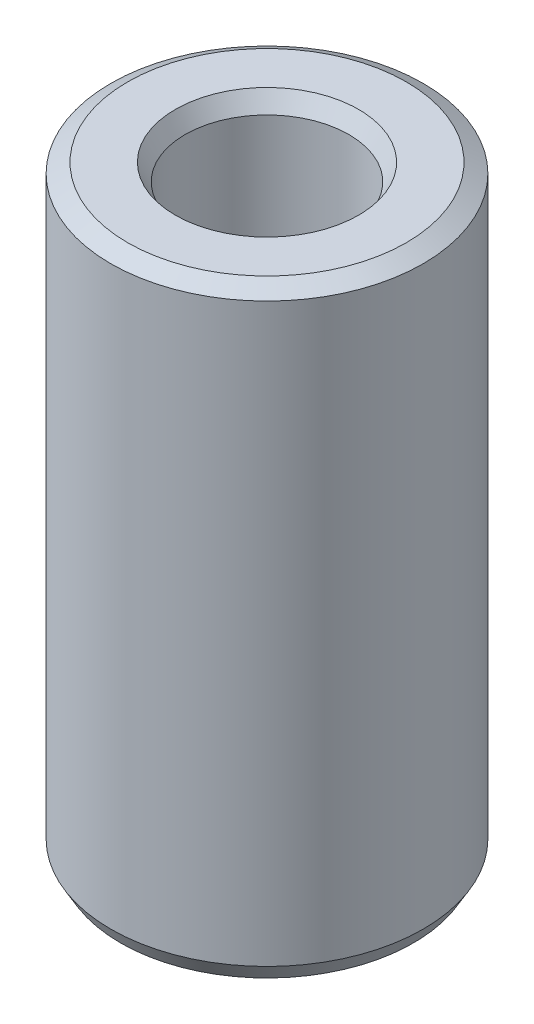
ISO-10303-21;
HEADER;
FILE_DESCRIPTION(('STEP AP214'),'2;1');
FILE_NAME('part.step','',(''),(''),'','','');
FILE_SCHEMA(('AUTOMOTIVE_DESIGN { 1 0 10303 214 1 1 1 1 }'));
ENDSEC;
DATA;
#1=APPLICATION_CONTEXT('core data for automotive mechanical design processes');
#2=APPLICATION_PROTOCOL_DEFINITION('international standard','automotive_design',2000,#1);
#3=PRODUCT_CONTEXT('',#1,'mechanical');
#4=PRODUCT('Part','Part','',(#3));
#5=PRODUCT_RELATED_PRODUCT_CATEGORY('part','',(#4));
#6=PRODUCT_DEFINITION_FORMATION('','',#4);
#7=PRODUCT_DEFINITION_CONTEXT('part definition',#1,'design');
#8=PRODUCT_DEFINITION('design','',#6,#7);
#9=PRODUCT_DEFINITION_SHAPE('','',#8);
#10=(LENGTH_UNIT() NAMED_UNIT(*) SI_UNIT(.MILLI.,.METRE.));
#11=(NAMED_UNIT(*) PLANE_ANGLE_UNIT() SI_UNIT($,.RADIAN.));
#12=(NAMED_UNIT(*) SI_UNIT($,.STERADIAN.) SOLID_ANGLE_UNIT());
#13=UNCERTAINTY_MEASURE_WITH_UNIT(LENGTH_MEASURE(1.E-05),#10,'distance_accuracy_value','');
#14=(GEOMETRIC_REPRESENTATION_CONTEXT(3) GLOBAL_UNCERTAINTY_ASSIGNED_CONTEXT((#13)) GLOBAL_UNIT_ASSIGNED_CONTEXT((#10,
#11,#12)) REPRESENTATION_CONTEXT('',''));
#15=CARTESIAN_POINT('',(0.,0.,0.));
#16=DIRECTION('',(0.,0.,1.));
#17=DIRECTION('',(1.,0.,0.));
#18=AXIS2_PLACEMENT_3D('',#15,#16,#17);
#19=CARTESIAN_POINT('',(0.,231.571872817268,0.));
#20=DIRECTION('',(0.,-1.,0.));
#21=DIRECTION('',(0.,0.,-1.));
#22=AXIS2_PLACEMENT_3D('',#19,#20,#21);
#23=CYLINDRICAL_SURFACE('',#22,60.);
#24=CARTESIAN_POINT('',(0.,6.48512513341329,0.));
#25=DIRECTION('',(0.,1.,0.));
#26=DIRECTION('',(0.,0.,1.));
#27=AXIS2_PLACEMENT_3D('',#24,#25,#26);
#28=CIRCLE('',#27,60.);
#29=CARTESIAN_POINT('',(0.,6.48512513341329,60.));
#30=VERTEX_POINT('',#29);
#31=EDGE_CURVE('E10',#30,#30,#28,.T.);
#32=ORIENTED_EDGE('',*,*,#31,.T.);
#33=EDGE_LOOP('',(#32));
#34=FACE_BOUND('',#33,.T.);
#35=CARTESIAN_POINT('',(0.,227.827684075764,0.));
#36=DIRECTION('',(0.,1.,0.));
#37=DIRECTION('',(0.,0.,1.));
#38=AXIS2_PLACEMENT_3D('',#35,#36,#37);
#39=CIRCLE('',#38,60.);
#40=CARTESIAN_POINT('',(0.,227.827684075764,60.));
#41=VERTEX_POINT('',#40);
#42=EDGE_CURVE('E50',#41,#41,#39,.F.);
#43=ORIENTED_EDGE('',*,*,#42,.T.);
#44=EDGE_LOOP('',(#43));
#45=FACE_BOUND('',#44,.T.);
#46=ADVANCED_FACE('F39',(#34,#45),#23,.T.);
#47=CARTESIAN_POINT('',(0.,231.571872817268,0.));
#48=DIRECTION('',(0.,1.,0.));
#49=DIRECTION('',(0.,0.,1.));
#50=AXIS2_PLACEMENT_3D('',#47,#48,#49);
#51=PLANE('',#50);
#52=CARTESIAN_POINT('',(0.,231.571872817268,0.));
#53=DIRECTION('',(0.,1.,0.));
#54=DIRECTION('',(0.,0.,1.));
#55=AXIS2_PLACEMENT_3D('',#52,#53,#54);
#56=CIRCLE('',#55,35.2071124474245);
#57=CARTESIAN_POINT('',(0.,231.571872817268,35.2071124474245));
#58=VERTEX_POINT('',#57);
#59=EDGE_CURVE('E58',#58,#58,#56,.F.);
#60=ORIENTED_EDGE('',*,*,#59,.T.);
#61=EDGE_LOOP('',(#60));
#62=FACE_BOUND('',#61,.T.);
#63=CARTESIAN_POINT('',(0.,231.571872817268,0.));
#64=DIRECTION('',(0.,1.,0.));
#65=DIRECTION('',(0.,0.,1.));
#66=AXIS2_PLACEMENT_3D('',#63,#64,#65);
#67=CIRCLE('',#66,53.5148748665867);
#68=CARTESIAN_POINT('',(0.,231.571872817268,53.5148748665867));
#69=VERTEX_POINT('',#68);
#70=EDGE_CURVE('E61',#69,#69,#67,.T.);
#71=ORIENTED_EDGE('',*,*,#70,.T.);
#72=EDGE_LOOP('',(#71));
#73=FACE_BOUND('',#72,.T.);
#74=ADVANCED_FACE('F88',(#62,#73),#51,.T.);
#75=CARTESIAN_POINT('',(0.,0.,0.));
#76=DIRECTION('',(0.,1.,0.));
#77=DIRECTION('',(0.,0.,1.));
#78=AXIS2_PLACEMENT_3D('',#75,#76,#77);
#79=PLANE('',#78);
#80=CARTESIAN_POINT('',(0.,0.,0.));
#81=DIRECTION('',(0.,1.,0.));
#82=DIRECTION('',(0.,0.,1.));
#83=AXIS2_PLACEMENT_3D('',#80,#81,#82);
#84=CIRCLE('',#83,37.9480488393332);
#85=CARTESIAN_POINT('',(0.,0.,37.9480488393332));
#86=VERTEX_POINT('',#85);
#87=EDGE_CURVE('E51',#86,#86,#84,.T.);
#88=ORIENTED_EDGE('',*,*,#87,.T.);
#89=EDGE_LOOP('',(#88));
#90=FACE_BOUND('',#89,.T.);
#91=CARTESIAN_POINT('',(0.,0.,0.));
#92=DIRECTION('',(0.,1.,0.));
#93=DIRECTION('',(0.,0.,1.));
#94=AXIS2_PLACEMENT_3D('',#91,#92,#93);
#95=CIRCLE('',#94,56.2558112584954);
#96=CARTESIAN_POINT('',(0.,0.,56.2558112584954));
#97=VERTEX_POINT('',#96);
#98=EDGE_CURVE('E54',#97,#97,#95,.F.);
#99=ORIENTED_EDGE('',*,*,#98,.T.);
#100=EDGE_LOOP('',(#99));
#101=FACE_BOUND('',#100,.T.);
#102=ADVANCED_FACE('F83',(#90,#101),#79,.F.);
#103=CARTESIAN_POINT('',(0.,231.571872817268,0.));
#104=DIRECTION('',(0.,-1.,0.));
#105=DIRECTION('',(0.,0.,-1.));
#106=AXIS2_PLACEMENT_3D('',#103,#104,#105);
#107=CYLINDRICAL_SURFACE('',#106,31.4629237059199);
#108=CARTESIAN_POINT('',(0.,225.086747683855,0.));
#109=DIRECTION('',(0.,1.,0.));
#110=DIRECTION('',(0.,0.,1.));
#111=AXIS2_PLACEMENT_3D('',#108,#109,#110);
#112=CIRCLE('',#111,31.4629237059199);
#113=CARTESIAN_POINT('',(0.,225.086747683855,31.4629237059199));
#114=VERTEX_POINT('',#113);
#115=EDGE_CURVE('E67',#114,#114,#112,.T.);
#116=ORIENTED_EDGE('',*,*,#115,.T.);
#117=EDGE_LOOP('',(#116));
#118=FACE_BOUND('',#117,.T.);
#119=CARTESIAN_POINT('',(0.,3.74418874150462,0.));
#120=DIRECTION('',(0.,1.,0.));
#121=DIRECTION('',(0.,0.,1.));
#122=AXIS2_PLACEMENT_3D('',#119,#120,#121);
#123=CIRCLE('',#122,31.4629237059199);
#124=CARTESIAN_POINT('',(0.,3.74418874150462,31.4629237059199));
#125=VERTEX_POINT('',#124);
#126=EDGE_CURVE('E69',#125,#125,#123,.F.);
#127=ORIENTED_EDGE('',*,*,#126,.T.);
#128=EDGE_LOOP('',(#127));
#129=FACE_BOUND('',#128,.T.);
#130=ADVANCED_FACE('F71',(#118,#129),#107,.F.);
#131=CARTESIAN_POINT('',(0.,225.086747683855,0.));
#132=DIRECTION('',(0.,1.,0.));
#133=DIRECTION('',(0.,0.,1.));
#134=AXIS2_PLACEMENT_3D('',#131,#132,#133);
#135=CONICAL_SURFACE('',#134,31.4629237059199,0.523598775598297);
#136=ORIENTED_EDGE('',*,*,#59,.F.);
#137=EDGE_LOOP('',(#136));
#138=FACE_BOUND('',#137,.T.);
#139=ORIENTED_EDGE('',*,*,#115,.F.);
#140=EDGE_LOOP('',(#139));
#141=FACE_BOUND('',#140,.T.);
#142=ADVANCED_FACE('F77',(#138,#141),#135,.F.);
#143=CARTESIAN_POINT('',(0.,0.,0.));
#144=DIRECTION('',(0.,-1.,0.));
#145=DIRECTION('',(0.,0.,-1.));
#146=AXIS2_PLACEMENT_3D('',#143,#144,#145);
#147=CONICAL_SURFACE('',#146,37.9480488393332,1.04719755119659);
#148=ORIENTED_EDGE('',*,*,#126,.F.);
#149=EDGE_LOOP('',(#148));
#150=FACE_BOUND('',#149,.T.);
#151=ORIENTED_EDGE('',*,*,#87,.F.);
#152=EDGE_LOOP('',(#151));
#153=FACE_BOUND('',#152,.T.);
#154=ADVANCED_FACE('F73',(#150,#153),#147,.F.);
#155=CARTESIAN_POINT('',(0.,6.48512513341329,0.));
#156=DIRECTION('',(0.,1.,0.));
#157=DIRECTION('',(0.,0.,1.));
#158=AXIS2_PLACEMENT_3D('',#155,#156,#157);
#159=CONICAL_SURFACE('',#158,60.,0.523598775598303);
#160=ORIENTED_EDGE('',*,*,#98,.F.);
#161=EDGE_LOOP('',(#160));
#162=FACE_BOUND('',#161,.T.);
#163=ORIENTED_EDGE('',*,*,#31,.F.);
#164=EDGE_LOOP('',(#163));
#165=FACE_BOUND('',#164,.T.);
#166=ADVANCED_FACE('F76',(#162,#165),#159,.T.);
#167=CARTESIAN_POINT('',(0.,231.571872817268,0.));
#168=DIRECTION('',(0.,-1.,0.));
#169=DIRECTION('',(0.,0.,-1.));
#170=AXIS2_PLACEMENT_3D('',#167,#168,#169);
#171=CONICAL_SURFACE('',#170,53.5148748665867,1.0471975511966);
#172=ORIENTED_EDGE('',*,*,#42,.F.);
#173=EDGE_LOOP('',(#172));
#174=FACE_BOUND('',#173,.T.);
#175=ORIENTED_EDGE('',*,*,#70,.F.);
#176=EDGE_LOOP('',(#175));
#177=FACE_BOUND('',#176,.T.);
#178=ADVANCED_FACE('F45',(#174,#177),#171,.T.);
#179=CLOSED_SHELL('',(#46,#74,#102,#130,#142,#154,#166,#178));
#180=MANIFOLD_SOLID_BREP('B2',#179);
#181=ADVANCED_BREP_SHAPE_REPRESENTATION('',(#18,#180),#14);
#182=SHAPE_DEFINITION_REPRESENTATION(#9,#181);
ENDSEC;
END-ISO-10303-21;
